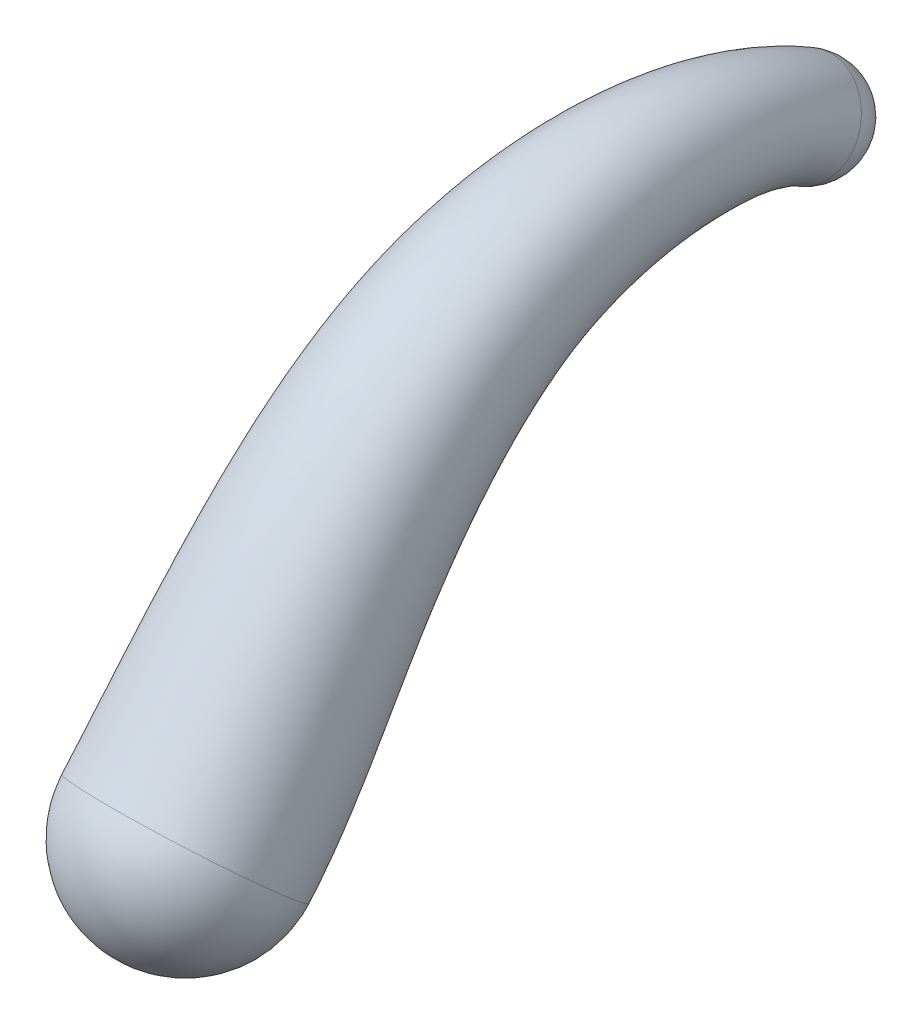
ISO-10303-21;
HEADER;
FILE_DESCRIPTION(('STEP AP214'),'2;1');
FILE_NAME('part.step','',(''),(''),'','','');
FILE_SCHEMA(('AUTOMOTIVE_DESIGN { 1 0 10303 214 1 1 1 1 }'));
ENDSEC;
DATA;
#1=APPLICATION_CONTEXT('core data for automotive mechanical design processes');
#2=APPLICATION_PROTOCOL_DEFINITION('international standard','automotive_design',2000,#1);
#3=PRODUCT_CONTEXT('',#1,'mechanical');
#4=PRODUCT('Part','Part','',(#3));
#5=PRODUCT_RELATED_PRODUCT_CATEGORY('part','',(#4));
#6=PRODUCT_DEFINITION_FORMATION('','',#4);
#7=PRODUCT_DEFINITION_CONTEXT('part definition',#1,'design');
#8=PRODUCT_DEFINITION('design','',#6,#7);
#9=PRODUCT_DEFINITION_SHAPE('','',#8);
#10=(LENGTH_UNIT() NAMED_UNIT(*) SI_UNIT(.MILLI.,.METRE.));
#11=(NAMED_UNIT(*) PLANE_ANGLE_UNIT() SI_UNIT($,.RADIAN.));
#12=(NAMED_UNIT(*) SI_UNIT($,.STERADIAN.) SOLID_ANGLE_UNIT());
#13=UNCERTAINTY_MEASURE_WITH_UNIT(LENGTH_MEASURE(1.E-05),#10,'distance_accuracy_value','');
#14=(GEOMETRIC_REPRESENTATION_CONTEXT(3) GLOBAL_UNCERTAINTY_ASSIGNED_CONTEXT((#13)) GLOBAL_UNIT_ASSIGNED_CONTEXT((#10,
#11,#12)) REPRESENTATION_CONTEXT('',''));
#15=CARTESIAN_POINT('',(0.,0.,0.));
#16=DIRECTION('',(0.,0.,1.));
#17=DIRECTION('',(1.,0.,0.));
#18=AXIS2_PLACEMENT_3D('',#15,#16,#17);
#19=CARTESIAN_POINT('',(0.,-51.0478085896344,-230.584495301686));
#20=DIRECTION('',(0.,0.,1.));
#21=DIRECTION('',(1.,0.,0.));
#22=AXIS2_PLACEMENT_3D('',#19,#20,#21);
#23=SPHERICAL_SURFACE('',#22,1.50000000000012);
#24=CARTESIAN_POINT('',(0.,-49.7568993178732,-231.348401874561));
#25=CARTESIAN_POINT('',(-0.827872514884715,-49.7568993178732,-231.348401874561));
#26=CARTESIAN_POINT('',(-1.50000000000012,-50.3353363861005,-231.006106805435));
#27=CARTESIAN_POINT('',(-1.50000000000012,-51.7602807931683,-230.162883797938));
#28=CARTESIAN_POINT('',(-0.827872514884714,-52.3387178613956,-229.820588728811));
#29=CARTESIAN_POINT('',(0.827872514884715,-52.3387178613956,-229.820588728811));
#30=CARTESIAN_POINT('',(1.50000000000012,-51.7602807931683,-230.162883797938));
#31=CARTESIAN_POINT('',(1.50000000000012,-50.3353363861005,-231.006106805435));
#32=CARTESIAN_POINT('',(0.827872514884714,-49.7568993178732,-231.348401874561));
#33=CARTESIAN_POINT('',(0.,-49.7568993178732,-231.348401874561));
#34=B_SPLINE_CURVE_WITH_KNOTS('',3,(#24,#25,#26,#27,#28,#29,#30,#31,#32,#33),.UNSPECIFIED.,.T.,
.F.,(4,2,2,2,4),(0.,0.25,0.5,0.75,1.),.UNSPECIFIED.);
#35=CARTESIAN_POINT('',(0.,-49.7568993178732,-231.348401874561));
#36=VERTEX_POINT('',#35);
#37=EDGE_CURVE('E64',#36,#36,#34,.F.);
#38=ORIENTED_EDGE('',*,*,#37,.T.);
#39=EDGE_LOOP('',(#38));
#40=FACE_BOUND('',#39,.T.);
#41=ADVANCED_FACE('F54',(#40),#23,.T.);
#42=CARTESIAN_POINT('',(0.,-60.6260491724179,-211.711044092599));
#43=DIRECTION('',(0.,0.,1.));
#44=DIRECTION('',(1.,0.,0.));
#45=AXIS2_PLACEMENT_3D('',#42,#43,#44);
#46=SPHERICAL_SURFACE('',#45,3.);
#47=CARTESIAN_POINT('',(0.,-58.6626402835232,-209.442779219395));
#48=CARTESIAN_POINT('',(1.6557450297693,-58.6626402835232,-209.442779219395));
#49=CARTESIAN_POINT('',(3.,-59.5424143360205,-210.459154662597));
#50=CARTESIAN_POINT('',(3.,-61.7096840088153,-212.962933522601));
#51=CARTESIAN_POINT('',(1.6557450297693,-62.5894580613125,-213.979308965803));
#52=CARTESIAN_POINT('',(-1.6557450297693,-62.5894580613125,-213.979308965803));
#53=CARTESIAN_POINT('',(-3.,-61.7096840088153,-212.962933522601));
#54=CARTESIAN_POINT('',(-3.,-59.5424143360205,-210.459154662597));
#55=CARTESIAN_POINT('',(-1.6557450297693,-58.6626402835232,-209.442779219395));
#56=CARTESIAN_POINT('',(0.,-58.6626402835232,-209.442779219395));
#57=B_SPLINE_CURVE_WITH_KNOTS('',3,(#47,#48,#49,#50,#51,#52,#53,#54,#55,#56),.UNSPECIFIED.,.T.,
.F.,(4,2,2,2,4),(0.,0.25,0.5,0.75,1.),.UNSPECIFIED.);
#58=CARTESIAN_POINT('',(0.,-58.6626402835232,-209.442779219395));
#59=VERTEX_POINT('',#58);
#60=EDGE_CURVE('E11',#59,#59,#57,.T.);
#61=ORIENTED_EDGE('',*,*,#60,.F.);
#62=EDGE_LOOP('',(#61));
#63=FACE_BOUND('',#62,.T.);
#64=ADVANCED_FACE('F86',(#63),#46,.T.);
#65=CARTESIAN_POINT('',(0.,-58.6626402835232,-209.442779219395));
#66=CARTESIAN_POINT('',(0.,-58.5879320130375,-209.507064955891));
#67=CARTESIAN_POINT('',(0.,-58.4376734213002,-209.636361005336));
#68=CARTESIAN_POINT('',(0.,-58.0711570596838,-209.944097590886));
#69=CARTESIAN_POINT('',(0.,-57.4908544559711,-210.418489872862));
#70=CARTESIAN_POINT('',(0.,-56.6036117280627,-211.124635756337));
#71=CARTESIAN_POINT('',(0.,-55.4517243504949,-212.039799276565));
#72=CARTESIAN_POINT('',(0.,-54.2342019921524,-213.045014316339));
#73=CARTESIAN_POINT('',(0.,-53.0656607593332,-214.095290469457));
#74=CARTESIAN_POINT('',(0.,-52.0817095196542,-215.07312858173));
#75=CARTESIAN_POINT('',(0.,-51.1570063377014,-216.115221207656));
#76=CARTESIAN_POINT('',(0.,-50.402687853373,-217.11264694937));
#77=CARTESIAN_POINT('',(0.,-49.7331310230892,-218.158445051499));
#78=CARTESIAN_POINT('',(0.,-49.2326635316351,-219.104933251268));
#79=CARTESIAN_POINT('',(0.,-48.7475008721767,-220.273390754991));
#80=CARTESIAN_POINT('',(0.,-48.3620596176314,-221.523675124813));
#81=CARTESIAN_POINT('',(0.,-48.0909209088526,-222.993558680091));
#82=CARTESIAN_POINT('',(0.,-48.0135902324956,-224.068301727507));
#83=CARTESIAN_POINT('',(0.,-48.0044807917905,-225.012806483934));
#84=CARTESIAN_POINT('',(0.,-48.036613621102,-225.827850194733));
#85=CARTESIAN_POINT('',(0.,-48.1419966663563,-226.718476322285));
#86=CARTESIAN_POINT('',(0.,-48.306255777049,-227.635697992357));
#87=CARTESIAN_POINT('',(0.,-48.5388739077289,-228.581873112139));
#88=CARTESIAN_POINT('',(0.,-48.9325475985146,-229.717843147251));
#89=CARTESIAN_POINT('',(0.,-49.314525282372,-230.547471836824));
#90=CARTESIAN_POINT('',(0.,-49.6038929037176,-231.085199732549));
#91=CARTESIAN_POINT('',(0.,-49.7059086055227,-231.260687481753));
#92=CARTESIAN_POINT('',(0.,-49.7568993178732,-231.348401874561));
#93=CARTESIAN_POINT('',(1.6557450297693,-58.6626402835232,-209.442779219395));
#94=CARTESIAN_POINT('',(1.65557945423165,-58.5879320130375,-209.507064955891));
#95=CARTESIAN_POINT('',(1.65524643692377,-58.4376734213002,-209.636361005336));
#96=CARTESIAN_POINT('',(1.6514817006844,-58.0711570596838,-209.944097590886));
#97=CARTESIAN_POINT('',(1.63996598884911,-57.4908544559711,-210.418489872862));
#98=CARTESIAN_POINT('',(1.61251102166857,-56.6036117280627,-211.124635756337));
#99=CARTESIAN_POINT('',(1.56772517023884,-55.4517243504949,-212.039799276565));
#100=CARTESIAN_POINT('',(1.51524094178289,-54.2342019921524,-213.045014316339));
#101=CARTESIAN_POINT('',(1.46641583804791,-53.0656607593332,-214.095290469457));
#102=CARTESIAN_POINT('',(1.42309929185299,-52.0817095196542,-215.07312858173));
#103=CARTESIAN_POINT('',(1.37883787756794,-51.1570063377014,-216.115221207656));
#104=CARTESIAN_POINT('',(1.33633855028176,-50.402687853373,-217.11264694937));
#105=CARTESIAN_POINT('',(1.29192057243636,-49.7331310230892,-218.158445051499));
#106=CARTESIAN_POINT('',(1.25216635962896,-49.2326635316351,-219.104933251268));
#107=CARTESIAN_POINT('',(1.20206171295216,-48.7475008721767,-220.273390754991));
#108=CARTESIAN_POINT('',(1.15449493585553,-48.3620596176314,-221.523675124813));
#109=CARTESIAN_POINT('',(1.10088549303377,-48.0909209088526,-222.993558680091));
#110=CARTESIAN_POINT('',(1.06188817572515,-48.0135902324956,-224.068301727507));
#111=CARTESIAN_POINT('',(1.02774637368903,-48.0044807917905,-225.012806483934));
#112=CARTESIAN_POINT('',(0.998220858908948,-48.036613621102,-225.827850194733));
#113=CARTESIAN_POINT('',(0.964732673538806,-48.1419966663563,-226.718476322285));
#114=CARTESIAN_POINT('',(0.928617354861954,-48.306255777049,-227.635697992357));
#115=CARTESIAN_POINT('',(0.891171765663588,-48.5388739077289,-228.581873112139));
#116=CARTESIAN_POINT('',(0.851667381987773,-48.9325475985146,-229.717843147251));
#117=CARTESIAN_POINT('',(0.833246410699354,-49.314525282372,-230.547471836824));
#118=CARTESIAN_POINT('',(0.828344172514102,-49.6038929037176,-231.085199732549));
#119=CARTESIAN_POINT('',(0.828029698873639,-49.7059086055227,-231.260687481753));
#120=CARTESIAN_POINT('',(0.827872514884714,-49.7568993178732,-231.348401874561));
#121=CARTESIAN_POINT('',(3.,-59.5424143360205,-210.459154662597));
#122=CARTESIAN_POINT('',(2.9996999981253,-59.4608365960045,-210.529135622959));
#123=CARTESIAN_POINT('',(2.99909661299917,-59.2967616381422,-210.669886312062));
#124=CARTESIAN_POINT('',(2.99227538840538,-58.9013376530754,-210.99719085495));
#125=CARTESIAN_POINT('',(2.97141037906836,-58.2846469399687,-211.487662635755));
#126=CARTESIAN_POINT('',(2.92166546058106,-57.3622722586134,-212.191566822819));
#127=CARTESIAN_POINT('',(2.84051917786632,-56.1895595780891,-213.076927024911));
#128=CARTESIAN_POINT('',(2.74542441234568,-54.9778541582167,-214.025520352675));
#129=CARTESIAN_POINT('',(2.65695951674195,-53.8325652026949,-215.006579283222));
#130=CARTESIAN_POINT('',(2.57847542876442,-52.8739114163186,-215.915143365765));
#131=CARTESIAN_POINT('',(2.49827935964282,-51.9787004352303,-216.876975817062));
#132=CARTESIAN_POINT('',(2.42127596868214,-51.2506317638933,-217.791109666117));
#133=CARTESIAN_POINT('',(2.34079622624572,-50.6043066466566,-218.744611506927));
#134=CARTESIAN_POINT('',(2.26876663456467,-50.1195183823526,-219.604671762871));
#135=CARTESIAN_POINT('',(2.17798336943155,-49.6441514936301,-220.662932784845));
#136=CARTESIAN_POINT('',(2.09179840210613,-49.2587106242908,-221.804131750843));
#137=CARTESIAN_POINT('',(1.99466489086274,-48.9703337014276,-223.162861718658));
#138=CARTESIAN_POINT('',(1.92400669783035,-48.8708500372112,-224.165450043781));
#139=CARTESIAN_POINT('',(1.86214608265905,-48.838398175349,-225.050752588439));
#140=CARTESIAN_POINT('',(1.80864959452368,-48.8477517953415,-225.81726215727));
#141=CARTESIAN_POINT('',(1.74797324985458,-48.923443219218,-226.659405135653));
#142=CARTESIAN_POINT('',(1.68253687282638,-49.0530166635473,-227.528155523984));
#143=CARTESIAN_POINT('',(1.61469021432803,-49.2458662408467,-228.422227399447));
#144=CARTESIAN_POINT('',(1.54311328134822,-49.5876077638368,-229.491355359209));
#145=CARTESIAN_POINT('',(1.50973681765867,-49.9306107888362,-230.26588181617));
#146=CARTESIAN_POINT('',(1.50085458380543,-50.194767021076,-230.763675030983));
#147=CARTESIAN_POINT('',(1.5002847974528,-50.2884904280613,-230.92531431746));
#148=CARTESIAN_POINT('',(1.50000000000012,-50.3353363861005,-231.006106805435));
#149=CARTESIAN_POINT('',(3.,-61.7096840088153,-212.962933522601));
#150=CARTESIAN_POINT('',(2.9996999981253,-61.6111837499561,-213.046944319297));
#151=CARTESIAN_POINT('',(2.99909661299917,-61.4130730175604,-213.215912813951));
#152=CARTESIAN_POINT('',(2.99227538840538,-60.9464368667806,-213.591421825223));
#153=CARTESIAN_POINT('',(2.97141037906836,-60.2401062674826,-214.121504469822));
#154=CARTESIAN_POINT('',(2.92166546058106,-59.2311861634299,-214.819886374622));
#155=CARTESIAN_POINT('',(2.84051917786632,-58.0071716203464,-215.631827921821));
#156=CARTESIAN_POINT('',(2.74542441234568,-56.8097958733017,-216.440937118505));
#157=CARTESIAN_POINT('',(2.65695951674195,-55.7217874834741,-217.25148364659));
#158=CARTESIAN_POINT('',(2.57847542876442,-54.8254524290341,-217.989395385707));
#159=CARTESIAN_POINT('',(2.49827935964282,-54.0028936844333,-218.753511796262));
#160=CARTESIAN_POINT('',(2.42127596868214,-53.3394898249888,-219.462461152279));
#161=CARTESIAN_POINT('',(2.34079622624572,-52.750394614671,-220.188596787526));
#162=CARTESIAN_POINT('',(2.26876663456467,-52.304231169318,-220.835747079824));
#163=CARTESIAN_POINT('',(2.17798336943155,-51.8529955638235,-221.622545795919));
#164=CARTESIAN_POINT('',(2.09179840210613,-51.4675556434157,-222.495019528681));
#165=CARTESIAN_POINT('',(1.99466489086274,-51.1367134324569,-223.579929419118));
#166=CARTESIAN_POINT('',(1.92400669783035,-50.9826572349711,-224.404768990534));
#167=CARTESIAN_POINT('',(1.86214608265905,-50.8927027435194,-225.144230500479));
#168=CARTESIAN_POINT('',(1.80864959452368,-50.8459411719041,-225.791179173323));
#169=CARTESIAN_POINT('',(1.74797324985458,-50.8484890990324,-226.513886873365));
#170=CARTESIAN_POINT('',(1.68253687282638,-50.8926165216508,-227.263231218045));
#171=CARTESIAN_POINT('',(1.61469021432803,-50.9874986953563,-228.028949931752));
#172=CARTESIAN_POINT('',(1.54311328134822,-51.2013084931649,-228.933416519244));
#173=CARTESIAN_POINT('',(1.50973681765867,-51.4482998252633,-229.572201989863));
#174=CARTESIAN_POINT('',(1.50085458380543,-51.6503493394625,-229.97161855605));
#175=CARTESIAN_POINT('',(1.5002847974528,-51.7236451843599,-230.099142999975));
#176=CARTESIAN_POINT('',(1.50000000000012,-51.7602807931683,-230.162883797938));
#177=CARTESIAN_POINT('',(1.6557450297693,-62.5894580613125,-213.979308965803));
#178=CARTESIAN_POINT('',(1.65557945423165,-62.4840883329231,-214.069014986365));
#179=CARTESIAN_POINT('',(1.65524643692377,-62.2721612344023,-214.249438120677));
#180=CARTESIAN_POINT('',(1.6514817006844,-61.7766174601722,-214.644515089287));
#181=CARTESIAN_POINT('',(1.63996598884911,-61.0338987514803,-215.190677232715));
#182=CARTESIAN_POINT('',(1.61251102166857,-59.9898466939805,-215.886817441103));
#183=CARTESIAN_POINT('',(1.56772517023884,-58.7450068479406,-216.668955670167));
#184=CARTESIAN_POINT('',(1.51524094178289,-57.5534480393659,-217.421443154841));
#185=CARTESIAN_POINT('',(1.46641583804791,-56.4886919268358,-218.162772460355));
#186=CARTESIAN_POINT('',(1.42309929185299,-55.6176543256986,-218.831410169742));
#187=CARTESIAN_POINT('',(1.37883787756794,-54.8245877819623,-219.515266405668));
#188=CARTESIAN_POINT('',(1.33633855028176,-54.1874337355091,-220.140923869026));
#189=CARTESIAN_POINT('',(1.29192057243636,-53.6215702382384,-220.774763242955));
#190=CARTESIAN_POINT('',(1.25216635962896,-53.1910860200356,-221.335485591427));
#191=CARTESIAN_POINT('',(1.20206171295216,-52.7496461852769,-222.012087825773));
#192=CARTESIAN_POINT('',(1.15449493585553,-52.3642066500751,-222.775476154712));
#193=CARTESIAN_POINT('',(1.10088549303377,-52.0161262250319,-223.749232457685));
#194=CARTESIAN_POINT('',(1.06188817572515,-51.8399170396868,-224.501917306809));
#195=CARTESIAN_POINT('',(1.02774637368903,-51.7266201270779,-225.182176604984));
#196=CARTESIAN_POINT('',(0.998220858908949,-51.6570793461436,-225.78059113586));
#197=CARTESIAN_POINT('',(0.964732673538806,-51.6299356518942,-226.454815686732));
#198=CARTESIAN_POINT('',(0.928617354861954,-51.6393774081491,-227.155688749673));
#199=CARTESIAN_POINT('',(0.891171765663589,-51.6944910284741,-227.86930421906));
#200=CARTESIAN_POINT('',(0.851667381987773,-51.8563686584872,-228.706928731202));
#201=CARTESIAN_POINT('',(0.833246410699354,-52.0643853317274,-229.290611969209));
#202=CARTESIAN_POINT('',(0.828344172514102,-52.2412234568209,-229.650093854484));
#203=CARTESIAN_POINT('',(0.828029698873639,-52.3062270068985,-229.763769835682));
#204=CARTESIAN_POINT('',(0.827872514884715,-52.3387178613956,-229.820588728811));
#205=CARTESIAN_POINT('',(-1.6557450297693,-62.5894580613125,-213.979308965803));
#206=CARTESIAN_POINT('',(-1.65557945423165,-62.4840883329231,-214.069014986365));
#207=CARTESIAN_POINT('',(-1.65524643692377,-62.2721612344023,-214.249438120677));
#208=CARTESIAN_POINT('',(-1.6514817006844,-61.7766174601722,-214.644515089287));
#209=CARTESIAN_POINT('',(-1.63996598884911,-61.0338987514803,-215.190677232715));
#210=CARTESIAN_POINT('',(-1.61251102166857,-59.9898466939805,-215.886817441103));
#211=CARTESIAN_POINT('',(-1.56772517023884,-58.7450068479406,-216.668955670167));
#212=CARTESIAN_POINT('',(-1.51524094178289,-57.5534480393659,-217.421443154841));
#213=CARTESIAN_POINT('',(-1.46641583804791,-56.4886919268358,-218.162772460355));
#214=CARTESIAN_POINT('',(-1.42309929185299,-55.6176543256986,-218.831410169742));
#215=CARTESIAN_POINT('',(-1.37883787756794,-54.8245877819623,-219.515266405668));
#216=CARTESIAN_POINT('',(-1.33633855028176,-54.1874337355091,-220.140923869026));
#217=CARTESIAN_POINT('',(-1.29192057243636,-53.6215702382384,-220.774763242955));
#218=CARTESIAN_POINT('',(-1.25216635962896,-53.1910860200356,-221.335485591427));
#219=CARTESIAN_POINT('',(-1.20206171295216,-52.7496461852769,-222.012087825773));
#220=CARTESIAN_POINT('',(-1.15449493585553,-52.3642066500751,-222.775476154712));
#221=CARTESIAN_POINT('',(-1.10088549303377,-52.0161262250319,-223.749232457685));
#222=CARTESIAN_POINT('',(-1.06188817572515,-51.8399170396868,-224.501917306809));
#223=CARTESIAN_POINT('',(-1.02774637368903,-51.7266201270779,-225.182176604984));
#224=CARTESIAN_POINT('',(-0.998220858908948,-51.6570793461436,-225.78059113586));
#225=CARTESIAN_POINT('',(-0.964732673538805,-51.6299356518942,-226.454815686732));
#226=CARTESIAN_POINT('',(-0.928617354861954,-51.6393774081492,-227.155688749673));
#227=CARTESIAN_POINT('',(-0.891171765663588,-51.6944910284741,-227.86930421906));
#228=CARTESIAN_POINT('',(-0.851667381987773,-51.8563686584872,-228.706928731202));
#229=CARTESIAN_POINT('',(-0.833246410699353,-52.0643853317274,-229.290611969209));
#230=CARTESIAN_POINT('',(-0.828344172514101,-52.2412234568209,-229.650093854484));
#231=CARTESIAN_POINT('',(-0.828029698873639,-52.3062270068985,-229.763769835682));
#232=CARTESIAN_POINT('',(-0.827872514884714,-52.3387178613956,-229.820588728811));
#233=CARTESIAN_POINT('',(-3.,-61.7096840088153,-212.962933522601));
#234=CARTESIAN_POINT('',(-2.9996999981253,-61.6111837499561,-213.046944319297));
#235=CARTESIAN_POINT('',(-2.99909661299917,-61.4130730175604,-213.215912813951));
#236=CARTESIAN_POINT('',(-2.99227538840538,-60.9464368667806,-213.591421825223));
#237=CARTESIAN_POINT('',(-2.97141037906835,-60.2401062674826,-214.121504469822));
#238=CARTESIAN_POINT('',(-2.92166546058106,-59.2311861634299,-214.819886374622));
#239=CARTESIAN_POINT('',(-2.84051917786631,-58.0071716203464,-215.631827921821));
#240=CARTESIAN_POINT('',(-2.74542441234568,-56.8097958733017,-216.440937118505));
#241=CARTESIAN_POINT('',(-2.65695951674195,-55.7217874834741,-217.25148364659));
#242=CARTESIAN_POINT('',(-2.57847542876442,-54.8254524290341,-217.989395385707));
#243=CARTESIAN_POINT('',(-2.49827935964282,-54.0028936844333,-218.753511796262));
#244=CARTESIAN_POINT('',(-2.42127596868214,-53.3394898249888,-219.462461152279));
#245=CARTESIAN_POINT('',(-2.34079622624572,-52.750394614671,-220.188596787526));
#246=CARTESIAN_POINT('',(-2.26876663456467,-52.304231169318,-220.835747079824));
#247=CARTESIAN_POINT('',(-2.17798336943155,-51.8529955638235,-221.622545795919));
#248=CARTESIAN_POINT('',(-2.09179840210613,-51.4675556434157,-222.495019528681));
#249=CARTESIAN_POINT('',(-1.99466489086274,-51.1367134324569,-223.579929419118));
#250=CARTESIAN_POINT('',(-1.92400669783035,-50.9826572349711,-224.404768990534));
#251=CARTESIAN_POINT('',(-1.86214608265905,-50.8927027435194,-225.144230500479));
#252=CARTESIAN_POINT('',(-1.80864959452368,-50.8459411719041,-225.791179173323));
#253=CARTESIAN_POINT('',(-1.74797324985458,-50.8484890990324,-226.513886873365));
#254=CARTESIAN_POINT('',(-1.68253687282638,-50.8926165216509,-227.263231218045));
#255=CARTESIAN_POINT('',(-1.61469021432803,-50.9874986953562,-228.028949931752));
#256=CARTESIAN_POINT('',(-1.54311328134822,-51.201308493165,-228.933416519244));
#257=CARTESIAN_POINT('',(-1.50973681765867,-51.4482998252633,-229.572201989863));
#258=CARTESIAN_POINT('',(-1.50085458380543,-51.6503493394625,-229.97161855605));
#259=CARTESIAN_POINT('',(-1.5002847974528,-51.7236451843599,-230.099142999975));
#260=CARTESIAN_POINT('',(-1.50000000000012,-51.7602807931683,-230.162883797938));
#261=CARTESIAN_POINT('',(-3.,-59.5424143360205,-210.459154662597));
#262=CARTESIAN_POINT('',(-2.9996999981253,-59.4608365960045,-210.529135622959));
#263=CARTESIAN_POINT('',(-2.99909661299917,-59.2967616381422,-210.669886312062));
#264=CARTESIAN_POINT('',(-2.99227538840538,-58.9013376530754,-210.99719085495));
#265=CARTESIAN_POINT('',(-2.97141037906835,-58.2846469399687,-211.487662635755));
#266=CARTESIAN_POINT('',(-2.92166546058106,-57.3622722586134,-212.191566822819));
#267=CARTESIAN_POINT('',(-2.84051917786631,-56.1895595780891,-213.076927024911));
#268=CARTESIAN_POINT('',(-2.74542441234568,-54.9778541582167,-214.025520352675));
#269=CARTESIAN_POINT('',(-2.65695951674195,-53.8325652026949,-215.006579283222));
#270=CARTESIAN_POINT('',(-2.57847542876442,-52.8739114163186,-215.915143365765));
#271=CARTESIAN_POINT('',(-2.49827935964282,-51.9787004352303,-216.876975817062));
#272=CARTESIAN_POINT('',(-2.42127596868214,-51.2506317638933,-217.791109666117));
#273=CARTESIAN_POINT('',(-2.34079622624572,-50.6043066466566,-218.744611506927));
#274=CARTESIAN_POINT('',(-2.26876663456467,-50.1195183823526,-219.604671762871));
#275=CARTESIAN_POINT('',(-2.17798336943155,-49.6441514936301,-220.662932784845));
#276=CARTESIAN_POINT('',(-2.09179840210613,-49.2587106242908,-221.804131750843));
#277=CARTESIAN_POINT('',(-1.99466489086274,-48.9703337014276,-223.162861718658));
#278=CARTESIAN_POINT('',(-1.92400669783035,-48.8708500372112,-224.165450043781));
#279=CARTESIAN_POINT('',(-1.86214608265905,-48.838398175349,-225.050752588439));
#280=CARTESIAN_POINT('',(-1.80864959452368,-48.8477517953415,-225.81726215727));
#281=CARTESIAN_POINT('',(-1.74797324985458,-48.923443219218,-226.659405135653));
#282=CARTESIAN_POINT('',(-1.68253687282638,-49.0530166635473,-227.528155523984));
#283=CARTESIAN_POINT('',(-1.61469021432803,-49.2458662408467,-228.422227399447));
#284=CARTESIAN_POINT('',(-1.54311328134823,-49.5876077638368,-229.491355359209));
#285=CARTESIAN_POINT('',(-1.50973681765867,-49.9306107888362,-230.26588181617));
#286=CARTESIAN_POINT('',(-1.50085458380543,-50.194767021076,-230.763675030983));
#287=CARTESIAN_POINT('',(-1.5002847974528,-50.2884904280613,-230.92531431746));
#288=CARTESIAN_POINT('',(-1.50000000000012,-50.3353363861005,-231.006106805435));
#289=CARTESIAN_POINT('',(-1.6557450297693,-58.6626402835232,-209.442779219395));
#290=CARTESIAN_POINT('',(-1.65557945423165,-58.5879320130375,-209.507064955891));
#291=CARTESIAN_POINT('',(-1.65524643692377,-58.4376734213002,-209.636361005336));
#292=CARTESIAN_POINT('',(-1.6514817006844,-58.0711570596838,-209.944097590886));
#293=CARTESIAN_POINT('',(-1.63996598884911,-57.4908544559711,-210.418489872862));
#294=CARTESIAN_POINT('',(-1.61251102166857,-56.6036117280627,-211.124635756337));
#295=CARTESIAN_POINT('',(-1.56772517023884,-55.4517243504949,-212.039799276565));
#296=CARTESIAN_POINT('',(-1.51524094178289,-54.2342019921524,-213.045014316339));
#297=CARTESIAN_POINT('',(-1.46641583804791,-53.0656607593332,-214.095290469457));
#298=CARTESIAN_POINT('',(-1.42309929185299,-52.0817095196542,-215.07312858173));
#299=CARTESIAN_POINT('',(-1.37883787756794,-51.1570063377014,-216.115221207656));
#300=CARTESIAN_POINT('',(-1.33633855028176,-50.4026878533731,-217.11264694937));
#301=CARTESIAN_POINT('',(-1.29192057243636,-49.7331310230892,-218.158445051499));
#302=CARTESIAN_POINT('',(-1.25216635962896,-49.2326635316351,-219.104933251268));
#303=CARTESIAN_POINT('',(-1.20206171295216,-48.7475008721767,-220.273390754991));
#304=CARTESIAN_POINT('',(-1.15449493585553,-48.3620596176314,-221.523675124813));
#305=CARTESIAN_POINT('',(-1.10088549303377,-48.0909209088526,-222.993558680091));
#306=CARTESIAN_POINT('',(-1.06188817572515,-48.0135902324956,-224.068301727507));
#307=CARTESIAN_POINT('',(-1.02774637368903,-48.0044807917905,-225.012806483934));
#308=CARTESIAN_POINT('',(-0.998220858908949,-48.036613621102,-225.827850194733));
#309=CARTESIAN_POINT('',(-0.964732673538806,-48.1419966663563,-226.718476322285));
#310=CARTESIAN_POINT('',(-0.928617354861954,-48.306255777049,-227.635697992357));
#311=CARTESIAN_POINT('',(-0.891171765663589,-48.5388739077289,-228.581873112139));
#312=CARTESIAN_POINT('',(-0.851667381987773,-48.9325475985146,-229.717843147251));
#313=CARTESIAN_POINT('',(-0.833246410699354,-49.314525282372,-230.547471836824));
#314=CARTESIAN_POINT('',(-0.828344172514102,-49.6038929037176,-231.085199732549));
#315=CARTESIAN_POINT('',(-0.82802969887364,-49.7059086055227,-231.260687481753));
#316=CARTESIAN_POINT('',(-0.827872514884715,-49.7568993178732,-231.348401874561));
#317=CARTESIAN_POINT('',(0.,-58.6626402835232,-209.442779219395));
#318=CARTESIAN_POINT('',(0.,-58.5879320130375,-209.507064955891));
#319=CARTESIAN_POINT('',(0.,-58.4376734213002,-209.636361005336));
#320=CARTESIAN_POINT('',(0.,-58.0711570596838,-209.944097590886));
#321=CARTESIAN_POINT('',(0.,-57.4908544559711,-210.418489872862));
#322=CARTESIAN_POINT('',(0.,-56.6036117280627,-211.124635756337));
#323=CARTESIAN_POINT('',(0.,-55.4517243504949,-212.039799276565));
#324=CARTESIAN_POINT('',(0.,-54.2342019921524,-213.045014316339));
#325=CARTESIAN_POINT('',(0.,-53.0656607593332,-214.095290469457));
#326=CARTESIAN_POINT('',(0.,-52.0817095196542,-215.07312858173));
#327=CARTESIAN_POINT('',(0.,-51.1570063377014,-216.115221207656));
#328=CARTESIAN_POINT('',(0.,-50.402687853373,-217.11264694937));
#329=CARTESIAN_POINT('',(0.,-49.7331310230892,-218.158445051499));
#330=CARTESIAN_POINT('',(0.,-49.2326635316351,-219.104933251268));
#331=CARTESIAN_POINT('',(0.,-48.7475008721767,-220.273390754991));
#332=CARTESIAN_POINT('',(0.,-48.3620596176314,-221.523675124813));
#333=CARTESIAN_POINT('',(0.,-48.0909209088526,-222.993558680091));
#334=CARTESIAN_POINT('',(0.,-48.0135902324956,-224.068301727507));
#335=CARTESIAN_POINT('',(0.,-48.0044807917905,-225.012806483934));
#336=CARTESIAN_POINT('',(0.,-48.036613621102,-225.827850194733));
#337=CARTESIAN_POINT('',(0.,-48.1419966663563,-226.718476322285));
#338=CARTESIAN_POINT('',(0.,-48.306255777049,-227.635697992357));
#339=CARTESIAN_POINT('',(0.,-48.5388739077289,-228.581873112139));
#340=CARTESIAN_POINT('',(0.,-48.9325475985146,-229.717843147251));
#341=CARTESIAN_POINT('',(0.,-49.314525282372,-230.547471836824));
#342=CARTESIAN_POINT('',(0.,-49.6038929037176,-231.085199732549));
#343=CARTESIAN_POINT('',(0.,-49.7059086055227,-231.260687481753));
#344=CARTESIAN_POINT('',(0.,-49.7568993178732,-231.348401874561));
#345=B_SPLINE_SURFACE_WITH_KNOTS('',3,3,((#65,#66,#67,#68,#69,#70,#71,#72,#73,#74,#75,#76,#77,
#78,#79,#80,#81,#82,#83,#84,#85,#86,#87,#88,#89,#90,#91,#92),(#93,#94,#95,#96,#97,#98,#99,#100,
#101,#102,#103,#104,#105,#106,#107,#108,#109,#110,#111,#112,#113,#114,#115,#116,#117,#118,#119,
#120),(#121,#122,#123,#124,#125,#126,#127,#128,#129,#130,#131,#132,#133,#134,#135,#136,#137,
#138,#139,#140,#141,#142,#143,#144,#145,#146,#147,#148),(#149,#150,#151,#152,#153,#154,#155,
#156,#157,#158,#159,#160,#161,#162,#163,#164,#165,#166,#167,#168,#169,#170,#171,#172,#173,#174,
#175,#176),(#177,#178,#179,#180,#181,#182,#183,#184,#185,#186,#187,#188,#189,#190,#191,#192,
#193,#194,#195,#196,#197,#198,#199,#200,#201,#202,#203,#204),(#205,#206,#207,#208,#209,#210,
#211,#212,#213,#214,#215,#216,#217,#218,#219,#220,#221,#222,#223,#224,#225,#226,#227,#228,#229,
#230,#231,#232),(#233,#234,#235,#236,#237,#238,#239,#240,#241,#242,#243,#244,#245,#246,#247,
#248,#249,#250,#251,#252,#253,#254,#255,#256,#257,#258,#259,#260),(#261,#262,#263,#264,#265,
#266,#267,#268,#269,#270,#271,#272,#273,#274,#275,#276,#277,#278,#279,#280,#281,#282,#283,#284,
#285,#286,#287,#288),(#289,#290,#291,#292,#293,#294,#295,#296,#297,#298,#299,#300,#301,#302,
#303,#304,#305,#306,#307,#308,#309,#310,#311,#312,#313,#314,#315,#316),(#317,#318,#319,#320,
#321,#322,#323,#324,#325,#326,#327,#328,#329,#330,#331,#332,#333,#334,#335,#336,#337,#338,#339,
#340,#341,#342,#343,#344)),.UNSPECIFIED.,.T.,.F.,.F.,(4,2,2,2,4),(4,1,1,1,1,1,1,1,1,1,1,1,1,1,1,
1,1,1,1,1,1,1,1,1,1,4),(0.,0.25,0.5,0.75,1.),(0.,0.0150463979511077,0.0302623866427936,
0.0706319720357176,0.12116349751606,0.181941379492919,0.257424451859308,0.310886528823882,
0.364053268678653,0.415171617558121,0.465757135219095,0.500015661540279,0.547919150487288,
0.57842774035974,0.631573384886327,0.684919171527232,0.738686520492785,0.748823424959276,
0.788698075207375,0.82864114583465,0.848523547294363,0.892370896861084,0.935796084812477,
0.978796431074825,0.989401777719146,1.),.UNSPECIFIED.);
#346=ORIENTED_EDGE('',*,*,#60,.T.);
#347=EDGE_LOOP('',(#346));
#348=FACE_BOUND('',#347,.T.);
#349=ORIENTED_EDGE('',*,*,#37,.F.);
#350=EDGE_LOOP('',(#349));
#351=FACE_BOUND('',#350,.T.);
#352=ADVANCED_FACE('F94',(#348,#351),#345,.T.);
#353=CLOSED_SHELL('',(#41,#64,#352));
#354=MANIFOLD_SOLID_BREP('B2',#353);
#355=ADVANCED_BREP_SHAPE_REPRESENTATION('',(#18,#354),#14);
#356=SHAPE_DEFINITION_REPRESENTATION(#9,#355);
ENDSEC;
END-ISO-10303-21;
